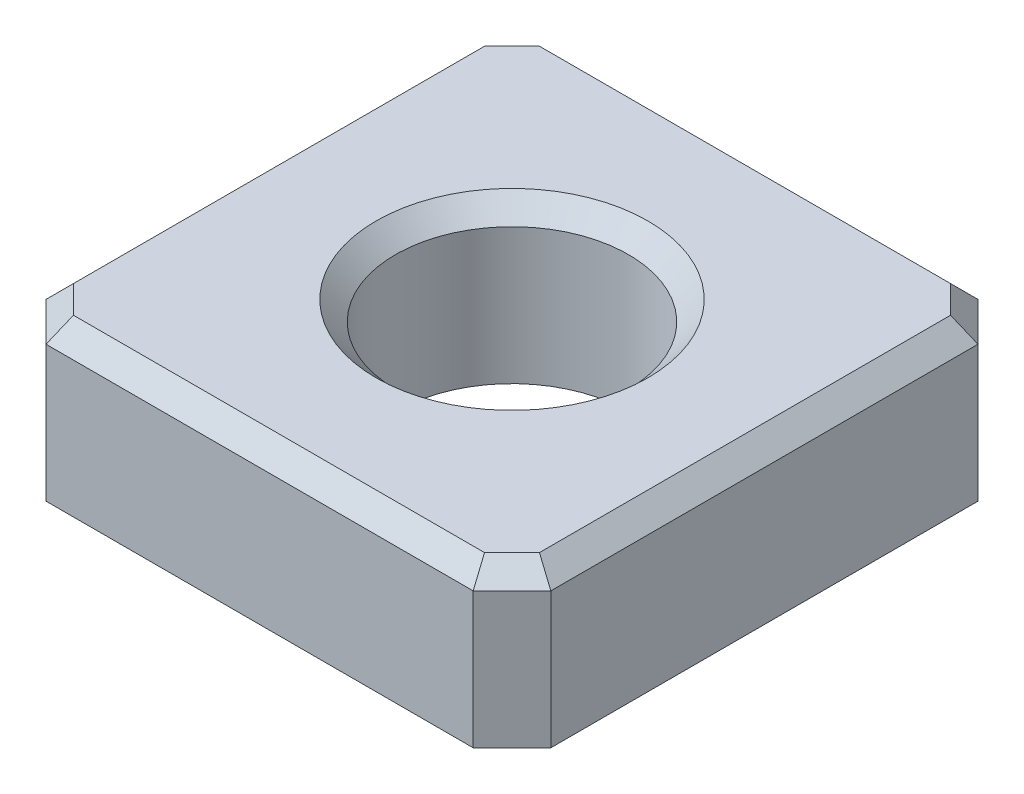
ISO-10303-21;
HEADER;
FILE_DESCRIPTION(('STEP AP214'),'2;1');
FILE_NAME('part.step','',(''),(''),'','','');
FILE_SCHEMA(('AUTOMOTIVE_DESIGN { 1 0 10303 214 1 1 1 1 }'));
ENDSEC;
DATA;
#1=APPLICATION_CONTEXT('core data for automotive mechanical design processes');
#2=APPLICATION_PROTOCOL_DEFINITION('international standard','automotive_design',2000,#1);
#3=PRODUCT_CONTEXT('',#1,'mechanical');
#4=PRODUCT('Part','Part','',(#3));
#5=PRODUCT_RELATED_PRODUCT_CATEGORY('part','',(#4));
#6=PRODUCT_DEFINITION_FORMATION('','',#4);
#7=PRODUCT_DEFINITION_CONTEXT('part definition',#1,'design');
#8=PRODUCT_DEFINITION('design','',#6,#7);
#9=PRODUCT_DEFINITION_SHAPE('','',#8);
#10=(LENGTH_UNIT() NAMED_UNIT(*) SI_UNIT(.MILLI.,.METRE.));
#11=(NAMED_UNIT(*) PLANE_ANGLE_UNIT() SI_UNIT($,.RADIAN.));
#12=(NAMED_UNIT(*) SI_UNIT($,.STERADIAN.) SOLID_ANGLE_UNIT());
#13=UNCERTAINTY_MEASURE_WITH_UNIT(LENGTH_MEASURE(1.E-05),#10,'distance_accuracy_value','');
#14=(GEOMETRIC_REPRESENTATION_CONTEXT(3) GLOBAL_UNCERTAINTY_ASSIGNED_CONTEXT((#13)) GLOBAL_UNIT_ASSIGNED_CONTEXT((#10,
#11,#12)) REPRESENTATION_CONTEXT('',''));
#15=CARTESIAN_POINT('',(0.,0.,0.));
#16=DIRECTION('',(0.,0.,1.));
#17=DIRECTION('',(1.,0.,0.));
#18=AXIS2_PLACEMENT_3D('',#15,#16,#17);
#19=CARTESIAN_POINT('',(0.,4.,0.));
#20=DIRECTION('',(0.,1.,0.));
#21=DIRECTION('',(0.,0.,1.));
#22=AXIS2_PLACEMENT_3D('',#19,#20,#21);
#23=PLANE('',#22);
#24=CARTESIAN_POINT('',(0.,4.,0.));
#25=DIRECTION('',(0.,1.,0.));
#26=DIRECTION('',(0.,0.,1.));
#27=AXIS2_PLACEMENT_3D('',#24,#25,#26);
#28=CIRCLE('',#27,3.5);
#29=CARTESIAN_POINT('',(0.,4.,3.5));
#30=VERTEX_POINT('',#29);
#31=EDGE_CURVE('E197',#30,#30,#28,.F.);
#32=ORIENTED_EDGE('',*,*,#31,.T.);
#33=EDGE_LOOP('',(#32));
#34=FACE_BOUND('',#33,.T.);
#35=DIRECTION('',(0.,0.,-1.));
#36=VECTOR('',#35,1.);
#37=CARTESIAN_POINT('',(6.00000000000003,4.,-5.5));
#38=LINE('',#37,#36);
#39=CARTESIAN_POINT('',(6.00000000000003,4.,5.29289321881345));
#40=VERTEX_POINT('',#39);
#41=CARTESIAN_POINT('',(6.00000000000003,4.,-5.29289321881345));
#42=VERTEX_POINT('',#41);
#43=EDGE_CURVE('E192',#40,#42,#38,.T.);
#44=ORIENTED_EDGE('',*,*,#43,.T.);
#45=DIRECTION('',(-0.707106781186546,0.,-0.707106781186549));
#46=VECTOR('',#45,1.);
#47=CARTESIAN_POINT('',(5.64644660940675,4.,-5.64644660940673));
#48=LINE('',#47,#46);
#49=CARTESIAN_POINT('',(5.29289321881349,4.,-6.));
#50=VERTEX_POINT('',#49);
#51=EDGE_CURVE('E194',#42,#50,#48,.T.);
#52=ORIENTED_EDGE('',*,*,#51,.T.);
#53=DIRECTION('',(-1.,0.,0.));
#54=VECTOR('',#53,1.);
#55=CARTESIAN_POINT('',(-5.50000000000003,4.,-6.));
#56=LINE('',#55,#54);
#57=CARTESIAN_POINT('',(-5.29289321881348,4.,-6.));
#58=VERTEX_POINT('',#57);
#59=EDGE_CURVE('E180',#50,#58,#56,.T.);
#60=ORIENTED_EDGE('',*,*,#59,.T.);
#61=DIRECTION('',(-0.707106781186549,0.,0.707106781186546));
#62=VECTOR('',#61,1.);
#63=CARTESIAN_POINT('',(-5.64644660940673,4.,-5.64644660940675));
#64=LINE('',#63,#62);
#65=CARTESIAN_POINT('',(-6.00000000000003,4.,-5.29289321881345));
#66=VERTEX_POINT('',#65);
#67=EDGE_CURVE('E182',#58,#66,#64,.T.);
#68=ORIENTED_EDGE('',*,*,#67,.T.);
#69=DIRECTION('',(0.,0.,1.));
#70=VECTOR('',#69,1.);
#71=CARTESIAN_POINT('',(-6.00000000000003,4.,5.5));
#72=LINE('',#71,#70);
#73=CARTESIAN_POINT('',(-6.00000000000003,4.,5.29289321881345));
#74=VERTEX_POINT('',#73);
#75=EDGE_CURVE('E184',#66,#74,#72,.T.);
#76=ORIENTED_EDGE('',*,*,#75,.T.);
#77=DIRECTION('',(0.707106781186546,0.,0.707106781186549));
#78=VECTOR('',#77,1.);
#79=CARTESIAN_POINT('',(-5.64644660940675,4.,5.64644660940673));
#80=LINE('',#79,#78);
#81=CARTESIAN_POINT('',(-5.29289321881349,4.,6.));
#82=VERTEX_POINT('',#81);
#83=EDGE_CURVE('E186',#74,#82,#80,.T.);
#84=ORIENTED_EDGE('',*,*,#83,.T.);
#85=DIRECTION('',(1.,0.,0.));
#86=VECTOR('',#85,1.);
#87=CARTESIAN_POINT('',(5.50000000000003,4.,6.));
#88=LINE('',#87,#86);
#89=CARTESIAN_POINT('',(5.29289321881348,4.,6.));
#90=VERTEX_POINT('',#89);
#91=EDGE_CURVE('E188',#82,#90,#88,.T.);
#92=ORIENTED_EDGE('',*,*,#91,.T.);
#93=DIRECTION('',(0.707106781186549,0.,-0.707106781186546));
#94=VECTOR('',#93,1.);
#95=CARTESIAN_POINT('',(5.64644660940673,4.,5.64644660940675));
#96=LINE('',#95,#94);
#97=EDGE_CURVE('E190',#90,#40,#96,.T.);
#98=ORIENTED_EDGE('',*,*,#97,.T.);
#99=EDGE_LOOP('',(#44,#52,#60,#68,#76,#84,#92,#98));
#100=FACE_BOUND('',#99,.T.);
#101=ADVANCED_FACE('F38',(#34,#100),#23,.T.);
#102=CARTESIAN_POINT('',(0.,0.,0.));
#103=DIRECTION('',(0.,1.,0.));
#104=DIRECTION('',(0.,0.,1.));
#105=AXIS2_PLACEMENT_3D('',#102,#103,#104);
#106=PLANE('',#105);
#107=DIRECTION('',(0.,0.,1.));
#108=VECTOR('',#107,1.);
#109=CARTESIAN_POINT('',(-6.50000000000003,0.,-6.5));
#110=LINE('',#109,#108);
#111=CARTESIAN_POINT('',(-6.50000000000003,0.,-5.5));
#112=VERTEX_POINT('',#111);
#113=CARTESIAN_POINT('',(-6.50000000000003,0.,5.5));
#114=VERTEX_POINT('',#113);
#115=EDGE_CURVE('E132',#112,#114,#110,.T.);
#116=ORIENTED_EDGE('',*,*,#115,.F.);
#117=DIRECTION('',(-0.707106781186549,0.,0.707106781186546));
#118=VECTOR('',#117,1.);
#119=CARTESIAN_POINT('',(-6.50000000000003,0.,-5.5));
#120=LINE('',#119,#118);
#121=CARTESIAN_POINT('',(-5.50000000000003,0.,-6.5));
#122=VERTEX_POINT('',#121);
#123=EDGE_CURVE('E138',#112,#122,#120,.F.);
#124=ORIENTED_EDGE('',*,*,#123,.T.);
#125=DIRECTION('',(-1.,0.,0.));
#126=VECTOR('',#125,1.);
#127=CARTESIAN_POINT('',(-6.50000000000003,0.,-6.5));
#128=LINE('',#127,#126);
#129=CARTESIAN_POINT('',(5.50000000000003,0.,-6.5));
#130=VERTEX_POINT('',#129);
#131=EDGE_CURVE('E152',#130,#122,#128,.T.);
#132=ORIENTED_EDGE('',*,*,#131,.F.);
#133=DIRECTION('',(-0.707106781186546,0.,-0.707106781186549));
#134=VECTOR('',#133,1.);
#135=CARTESIAN_POINT('',(5.50000000000003,0.,-6.5));
#136=LINE('',#135,#134);
#137=CARTESIAN_POINT('',(6.50000000000003,0.,-5.5));
#138=VERTEX_POINT('',#137);
#139=EDGE_CURVE('E162',#130,#138,#136,.F.);
#140=ORIENTED_EDGE('',*,*,#139,.T.);
#141=DIRECTION('',(0.,0.,-1.));
#142=VECTOR('',#141,1.);
#143=CARTESIAN_POINT('',(6.50000000000003,0.,-6.5));
#144=LINE('',#143,#142);
#145=CARTESIAN_POINT('',(6.50000000000003,0.,5.5));
#146=VERTEX_POINT('',#145);
#147=EDGE_CURVE('E156',#146,#138,#144,.T.);
#148=ORIENTED_EDGE('',*,*,#147,.F.);
#149=DIRECTION('',(0.707106781186549,0.,-0.707106781186546));
#150=VECTOR('',#149,1.);
#151=CARTESIAN_POINT('',(6.50000000000003,0.,5.5));
#152=LINE('',#151,#150);
#153=CARTESIAN_POINT('',(5.50000000000003,0.,6.5));
#154=VERTEX_POINT('',#153);
#155=EDGE_CURVE('E135',#146,#154,#152,.F.);
#156=ORIENTED_EDGE('',*,*,#155,.T.);
#157=DIRECTION('',(1.,0.,0.));
#158=VECTOR('',#157,1.);
#159=CARTESIAN_POINT('',(-6.50000000000003,0.,6.5));
#160=LINE('',#159,#158);
#161=CARTESIAN_POINT('',(-5.50000000000003,0.,6.5));
#162=VERTEX_POINT('',#161);
#163=EDGE_CURVE('E151',#162,#154,#160,.T.);
#164=ORIENTED_EDGE('',*,*,#163,.F.);
#165=DIRECTION('',(0.707106781186546,0.,0.707106781186549));
#166=VECTOR('',#165,1.);
#167=CARTESIAN_POINT('',(-5.50000000000003,0.,6.5));
#168=LINE('',#167,#166);
#169=EDGE_CURVE('E145',#162,#114,#168,.F.);
#170=ORIENTED_EDGE('',*,*,#169,.T.);
#171=EDGE_LOOP('',(#116,#124,#132,#140,#148,#156,#164,#170));
#172=FACE_BOUND('',#171,.T.);
#173=CARTESIAN_POINT('',(0.,0.,0.));
#174=DIRECTION('',(0.,1.,0.));
#175=DIRECTION('',(0.,0.,1.));
#176=AXIS2_PLACEMENT_3D('',#173,#174,#175);
#177=CIRCLE('',#176,3.);
#178=CARTESIAN_POINT('',(0.,0.,3.));
#179=VERTEX_POINT('',#178);
#180=EDGE_CURVE('E234',#179,#179,#177,.T.);
#181=ORIENTED_EDGE('',*,*,#180,.T.);
#182=EDGE_LOOP('',(#181));
#183=FACE_BOUND('',#182,.T.);
#184=ADVANCED_FACE('F147',(#172,#183),#106,.F.);
#185=CARTESIAN_POINT('',(6.50000000000003,4.,-6.5));
#186=DIRECTION('',(-1.,0.,0.));
#187=DIRECTION('',(0.,0.,1.));
#188=AXIS2_PLACEMENT_3D('',#185,#186,#187);
#189=PLANE('',#188);
#190=DIRECTION('',(0.,1.,0.));
#191=VECTOR('',#190,1.);
#192=CARTESIAN_POINT('',(6.50000000000003,4.,-5.5));
#193=LINE('',#192,#191);
#194=CARTESIAN_POINT('',(6.50000000000003,3.5,-5.5));
#195=VERTEX_POINT('',#194);
#196=EDGE_CURVE('E174',#138,#195,#193,.T.);
#197=ORIENTED_EDGE('',*,*,#196,.T.);
#198=DIRECTION('',(0.,0.,1.));
#199=VECTOR('',#198,1.);
#200=CARTESIAN_POINT('',(6.50000000000003,3.5,5.5));
#201=LINE('',#200,#199);
#202=CARTESIAN_POINT('',(6.50000000000003,3.5,5.5));
#203=VERTEX_POINT('',#202);
#204=EDGE_CURVE('E203',#195,#203,#201,.T.);
#205=ORIENTED_EDGE('',*,*,#204,.T.);
#206=DIRECTION('',(0.,-1.,0.));
#207=VECTOR('',#206,1.);
#208=CARTESIAN_POINT('',(6.50000000000003,4.,5.5));
#209=LINE('',#208,#207);
#210=EDGE_CURVE('E172',#203,#146,#209,.T.);
#211=ORIENTED_EDGE('',*,*,#210,.T.);
#212=ORIENTED_EDGE('',*,*,#147,.T.);
#213=EDGE_LOOP('',(#197,#205,#211,#212));
#214=FACE_BOUND('',#213,.T.);
#215=ADVANCED_FACE('F246',(#214),#189,.F.);
#216=CARTESIAN_POINT('',(-6.50000000000003,4.,-6.5));
#217=DIRECTION('',(0.,0.,1.));
#218=DIRECTION('',(1.,0.,0.));
#219=AXIS2_PLACEMENT_3D('',#216,#217,#218);
#220=PLANE('',#219);
#221=DIRECTION('',(0.,1.,0.));
#222=VECTOR('',#221,1.);
#223=CARTESIAN_POINT('',(-5.50000000000003,4.,-6.5));
#224=LINE('',#223,#222);
#225=CARTESIAN_POINT('',(-5.50000000000003,3.5,-6.5));
#226=VERTEX_POINT('',#225);
#227=EDGE_CURVE('E140',#122,#226,#224,.T.);
#228=ORIENTED_EDGE('',*,*,#227,.T.);
#229=DIRECTION('',(1.,0.,0.));
#230=VECTOR('',#229,1.);
#231=CARTESIAN_POINT('',(5.50000000000003,3.5,-6.5));
#232=LINE('',#231,#230);
#233=CARTESIAN_POINT('',(5.50000000000003,3.5,-6.5));
#234=VERTEX_POINT('',#233);
#235=EDGE_CURVE('E11',#226,#234,#232,.T.);
#236=ORIENTED_EDGE('',*,*,#235,.T.);
#237=DIRECTION('',(0.,-1.,0.));
#238=VECTOR('',#237,1.);
#239=CARTESIAN_POINT('',(5.50000000000003,4.,-6.5));
#240=LINE('',#239,#238);
#241=EDGE_CURVE('E144',#234,#130,#240,.T.);
#242=ORIENTED_EDGE('',*,*,#241,.T.);
#243=ORIENTED_EDGE('',*,*,#131,.T.);
#244=EDGE_LOOP('',(#228,#236,#242,#243));
#245=FACE_BOUND('',#244,.T.);
#246=ADVANCED_FACE('F314',(#245),#220,.F.);
#247=CARTESIAN_POINT('',(-6.50000000000003,4.,-6.5));
#248=DIRECTION('',(1.,0.,0.));
#249=DIRECTION('',(0.,0.,-1.));
#250=AXIS2_PLACEMENT_3D('',#247,#248,#249);
#251=PLANE('',#250);
#252=DIRECTION('',(0.,1.,0.));
#253=VECTOR('',#252,1.);
#254=CARTESIAN_POINT('',(-6.50000000000003,4.,5.5));
#255=LINE('',#254,#253);
#256=CARTESIAN_POINT('',(-6.50000000000003,3.5,5.5));
#257=VERTEX_POINT('',#256);
#258=EDGE_CURVE('E136',#114,#257,#255,.T.);
#259=ORIENTED_EDGE('',*,*,#258,.T.);
#260=DIRECTION('',(0.,0.,-1.));
#261=VECTOR('',#260,1.);
#262=CARTESIAN_POINT('',(-6.50000000000003,3.5,-5.5));
#263=LINE('',#262,#261);
#264=CARTESIAN_POINT('',(-6.50000000000003,3.5,-5.5));
#265=VERTEX_POINT('',#264);
#266=EDGE_CURVE('E63',#257,#265,#263,.T.);
#267=ORIENTED_EDGE('',*,*,#266,.T.);
#268=DIRECTION('',(0.,-1.,0.));
#269=VECTOR('',#268,1.);
#270=CARTESIAN_POINT('',(-6.50000000000003,4.,-5.5));
#271=LINE('',#270,#269);
#272=EDGE_CURVE('E128',#265,#112,#271,.T.);
#273=ORIENTED_EDGE('',*,*,#272,.T.);
#274=ORIENTED_EDGE('',*,*,#115,.T.);
#275=EDGE_LOOP('',(#259,#267,#273,#274));
#276=FACE_BOUND('',#275,.T.);
#277=ADVANCED_FACE('F130',(#276),#251,.F.);
#278=CARTESIAN_POINT('',(-6.50000000000003,4.,6.5));
#279=DIRECTION('',(0.,0.,-1.));
#280=DIRECTION('',(-1.,0.,0.));
#281=AXIS2_PLACEMENT_3D('',#278,#279,#280);
#282=PLANE('',#281);
#283=DIRECTION('',(0.,1.,0.));
#284=VECTOR('',#283,1.);
#285=CARTESIAN_POINT('',(5.50000000000003,4.,6.5));
#286=LINE('',#285,#284);
#287=CARTESIAN_POINT('',(5.50000000000003,3.5,6.5));
#288=VERTEX_POINT('',#287);
#289=EDGE_CURVE('E167',#154,#288,#286,.T.);
#290=ORIENTED_EDGE('',*,*,#289,.T.);
#291=DIRECTION('',(-1.,0.,0.));
#292=VECTOR('',#291,1.);
#293=CARTESIAN_POINT('',(-5.50000000000003,3.5,6.5));
#294=LINE('',#293,#292);
#295=CARTESIAN_POINT('',(-5.50000000000003,3.5,6.5));
#296=VERTEX_POINT('',#295);
#297=EDGE_CURVE('E207',#288,#296,#294,.T.);
#298=ORIENTED_EDGE('',*,*,#297,.T.);
#299=DIRECTION('',(0.,-1.,0.));
#300=VECTOR('',#299,1.);
#301=CARTESIAN_POINT('',(-5.50000000000003,4.,6.5));
#302=LINE('',#301,#300);
#303=EDGE_CURVE('E170',#296,#162,#302,.T.);
#304=ORIENTED_EDGE('',*,*,#303,.T.);
#305=ORIENTED_EDGE('',*,*,#163,.T.);
#306=EDGE_LOOP('',(#290,#298,#304,#305));
#307=FACE_BOUND('',#306,.T.);
#308=ADVANCED_FACE('F282',(#307),#282,.F.);
#309=CARTESIAN_POINT('',(0.,4.,0.));
#310=DIRECTION('',(0.,-1.,0.));
#311=DIRECTION('',(0.,0.,-1.));
#312=AXIS2_PLACEMENT_3D('',#309,#310,#311);
#313=CYLINDRICAL_SURFACE('',#312,3.);
#314=CARTESIAN_POINT('',(0.,3.5,0.));
#315=DIRECTION('',(0.,1.,0.));
#316=DIRECTION('',(0.,0.,1.));
#317=AXIS2_PLACEMENT_3D('',#314,#315,#316);
#318=CIRCLE('',#317,3.);
#319=CARTESIAN_POINT('',(0.,3.5,3.));
#320=VERTEX_POINT('',#319);
#321=EDGE_CURVE('E177',#320,#320,#318,.T.);
#322=ORIENTED_EDGE('',*,*,#321,.T.);
#323=EDGE_LOOP('',(#322));
#324=FACE_BOUND('',#323,.T.);
#325=ORIENTED_EDGE('',*,*,#180,.F.);
#326=EDGE_LOOP('',(#325));
#327=FACE_BOUND('',#326,.T.);
#328=ADVANCED_FACE('F308',(#324,#327),#313,.F.);
#329=CARTESIAN_POINT('',(-6.50000000000003,4.,-5.5));
#330=DIRECTION('',(0.707106781186546,0.,0.707106781186549));
#331=DIRECTION('',(0.,-1.,0.));
#332=AXIS2_PLACEMENT_3D('',#329,#330,#331);
#333=PLANE('',#332);
#334=ORIENTED_EDGE('',*,*,#272,.F.);
#335=DIRECTION('',(-0.707106781186549,0.,0.707106781186546));
#336=VECTOR('',#335,1.);
#337=CARTESIAN_POINT('',(-6.50000000000003,3.5,-5.5));
#338=LINE('',#337,#336);
#339=EDGE_CURVE('E48',#265,#226,#338,.F.);
#340=ORIENTED_EDGE('',*,*,#339,.T.);
#341=ORIENTED_EDGE('',*,*,#227,.F.);
#342=ORIENTED_EDGE('',*,*,#123,.F.);
#343=EDGE_LOOP('',(#334,#340,#341,#342));
#344=FACE_BOUND('',#343,.T.);
#345=ADVANCED_FACE('F139',(#344),#333,.F.);
#346=CARTESIAN_POINT('',(-5.50000000000003,4.,6.5));
#347=DIRECTION('',(0.707106781186549,0.,-0.707106781186546));
#348=DIRECTION('',(0.,-1.,0.));
#349=AXIS2_PLACEMENT_3D('',#346,#347,#348);
#350=PLANE('',#349);
#351=ORIENTED_EDGE('',*,*,#303,.F.);
#352=DIRECTION('',(0.707106781186546,0.,0.707106781186549));
#353=VECTOR('',#352,1.);
#354=CARTESIAN_POINT('',(-5.50000000000003,3.5,6.5));
#355=LINE('',#354,#353);
#356=EDGE_CURVE('E209',#296,#257,#355,.F.);
#357=ORIENTED_EDGE('',*,*,#356,.T.);
#358=ORIENTED_EDGE('',*,*,#258,.F.);
#359=ORIENTED_EDGE('',*,*,#169,.F.);
#360=EDGE_LOOP('',(#351,#357,#358,#359));
#361=FACE_BOUND('',#360,.T.);
#362=ADVANCED_FACE('F285',(#361),#350,.F.);
#363=CARTESIAN_POINT('',(5.50000000000003,4.,-6.5));
#364=DIRECTION('',(-0.707106781186549,0.,0.707106781186546));
#365=DIRECTION('',(0.,-1.,0.));
#366=AXIS2_PLACEMENT_3D('',#363,#364,#365);
#367=PLANE('',#366);
#368=ORIENTED_EDGE('',*,*,#241,.F.);
#369=DIRECTION('',(-0.707106781186546,0.,-0.707106781186549));
#370=VECTOR('',#369,1.);
#371=CARTESIAN_POINT('',(5.50000000000003,3.5,-6.5));
#372=LINE('',#371,#370);
#373=EDGE_CURVE('E200',#234,#195,#372,.F.);
#374=ORIENTED_EDGE('',*,*,#373,.T.);
#375=ORIENTED_EDGE('',*,*,#196,.F.);
#376=ORIENTED_EDGE('',*,*,#139,.F.);
#377=EDGE_LOOP('',(#368,#374,#375,#376));
#378=FACE_BOUND('',#377,.T.);
#379=ADVANCED_FACE('F252',(#378),#367,.F.);
#380=CARTESIAN_POINT('',(6.50000000000003,4.,5.5));
#381=DIRECTION('',(-0.707106781186546,0.,-0.707106781186549));
#382=DIRECTION('',(0.,-1.,0.));
#383=AXIS2_PLACEMENT_3D('',#380,#381,#382);
#384=PLANE('',#383);
#385=ORIENTED_EDGE('',*,*,#210,.F.);
#386=DIRECTION('',(0.707106781186549,0.,-0.707106781186546));
#387=VECTOR('',#386,1.);
#388=CARTESIAN_POINT('',(6.50000000000003,3.5,5.5));
#389=LINE('',#388,#387);
#390=EDGE_CURVE('E205',#203,#288,#389,.F.);
#391=ORIENTED_EDGE('',*,*,#390,.T.);
#392=ORIENTED_EDGE('',*,*,#289,.F.);
#393=ORIENTED_EDGE('',*,*,#155,.F.);
#394=EDGE_LOOP('',(#385,#391,#392,#393));
#395=FACE_BOUND('',#394,.T.);
#396=ADVANCED_FACE('F274',(#395),#384,.F.);
#397=CARTESIAN_POINT('',(0.,3.5,0.));
#398=DIRECTION('',(0.,1.,0.));
#399=DIRECTION('',(0.,0.,1.));
#400=AXIS2_PLACEMENT_3D('',#397,#398,#399);
#401=CONICAL_SURFACE('',#400,3.,0.78539816339745);
#402=ORIENTED_EDGE('',*,*,#31,.F.);
#403=EDGE_LOOP('',(#402));
#404=FACE_BOUND('',#403,.T.);
#405=ORIENTED_EDGE('',*,*,#321,.F.);
#406=EDGE_LOOP('',(#405));
#407=FACE_BOUND('',#406,.T.);
#408=ADVANCED_FACE('F341',(#404,#407),#401,.F.);
#409=CARTESIAN_POINT('',(-5.64644660940675,4.,5.64644660940673));
#410=DIRECTION('',(-0.5,0.707106781186548,0.499999999999999));
#411=DIRECTION('',(-0.707106781186546,0.,-0.707106781186549));
#412=AXIS2_PLACEMENT_3D('',#409,#410,#411);
#413=PLANE('',#412);
#414=DIRECTION('',(0.678598344545847,0.678598344545847,-0.281084637714821));
#415=VECTOR('',#414,1.);
#416=CARTESIAN_POINT('',(-4.99041465271166,5.00958534728837,4.87470927559345));
#417=LINE('',#416,#415);
#418=EDGE_CURVE('E228',#257,#74,#417,.T.);
#419=ORIENTED_EDGE('',*,*,#418,.F.);
#420=ORIENTED_EDGE('',*,*,#356,.F.);
#421=DIRECTION('',(0.281084637714823,0.678598344545847,-0.678598344545847));
#422=VECTOR('',#421,1.);
#423=CARTESIAN_POINT('',(-5.25338893203385,4.09537178491527,5.90462821508473));
#424=LINE('',#423,#422);
#425=EDGE_CURVE('E43',#82,#296,#424,.F.);
#426=ORIENTED_EDGE('',*,*,#425,.F.);
#427=ORIENTED_EDGE('',*,*,#83,.F.);
#428=EDGE_LOOP('',(#419,#420,#426,#427));
#429=FACE_BOUND('',#428,.T.);
#430=ADVANCED_FACE('F41',(#429),#413,.T.);
#431=CARTESIAN_POINT('',(0.,4.,6.));
#432=DIRECTION('',(0.,0.707106781186547,0.707106781186547));
#433=DIRECTION('',(-1.,0.,0.));
#434=AXIS2_PLACEMENT_3D('',#431,#432,#433);
#435=PLANE('',#434);
#436=ORIENTED_EDGE('',*,*,#425,.T.);
#437=ORIENTED_EDGE('',*,*,#297,.F.);
#438=DIRECTION('',(-0.281084637714821,0.678598344545847,-0.678598344545847));
#439=VECTOR('',#438,1.);
#440=CARTESIAN_POINT('',(4.87470927559348,5.00958534728838,4.99041465271162));
#441=LINE('',#440,#439);
#442=EDGE_CURVE('E226',#90,#288,#441,.F.);
#443=ORIENTED_EDGE('',*,*,#442,.F.);
#444=ORIENTED_EDGE('',*,*,#91,.F.);
#445=EDGE_LOOP('',(#436,#437,#443,#444));
#446=FACE_BOUND('',#445,.T.);
#447=ADVANCED_FACE('F279',(#446),#435,.T.);
#448=CARTESIAN_POINT('',(-6.00000000000003,4.,0.));
#449=DIRECTION('',(-0.707106781186547,0.707106781186547,0.));
#450=DIRECTION('',(0.,0.,-1.));
#451=AXIS2_PLACEMENT_3D('',#448,#449,#450);
#452=PLANE('',#451);
#453=ORIENTED_EDGE('',*,*,#418,.T.);
#454=ORIENTED_EDGE('',*,*,#75,.F.);
#455=DIRECTION('',(0.678598344545847,0.678598344545847,0.281084637714822));
#456=VECTOR('',#455,1.);
#457=CARTESIAN_POINT('',(-5.90462821508475,4.09537178491528,-5.25338893203381));
#458=LINE('',#457,#456);
#459=EDGE_CURVE('E223',#265,#66,#458,.T.);
#460=ORIENTED_EDGE('',*,*,#459,.F.);
#461=ORIENTED_EDGE('',*,*,#266,.F.);
#462=EDGE_LOOP('',(#453,#454,#460,#461));
#463=FACE_BOUND('',#462,.T.);
#464=ADVANCED_FACE('F288',(#463),#452,.T.);
#465=CARTESIAN_POINT('',(5.64644660940673,4.,5.64644660940675));
#466=DIRECTION('',(0.499999999999999,0.707106781186548,0.500000000000001));
#467=DIRECTION('',(-0.707106781186549,0.,0.707106781186546));
#468=AXIS2_PLACEMENT_3D('',#465,#466,#467);
#469=PLANE('',#468);
#470=ORIENTED_EDGE('',*,*,#442,.T.);
#471=ORIENTED_EDGE('',*,*,#390,.F.);
#472=DIRECTION('',(-0.678598344545847,0.678598344545847,-0.281084637714822));
#473=VECTOR('',#472,1.);
#474=CARTESIAN_POINT('',(5.90462821508475,4.09537178491528,5.25338893203381));
#475=LINE('',#474,#473);
#476=EDGE_CURVE('E220',#40,#203,#475,.F.);
#477=ORIENTED_EDGE('',*,*,#476,.F.);
#478=ORIENTED_EDGE('',*,*,#97,.F.);
#479=EDGE_LOOP('',(#470,#471,#477,#478));
#480=FACE_BOUND('',#479,.T.);
#481=ADVANCED_FACE('F277',(#480),#469,.T.);
#482=CARTESIAN_POINT('',(-5.64644660940673,4.,-5.64644660940675));
#483=DIRECTION('',(-0.499999999999999,0.707106781186548,-0.500000000000001));
#484=DIRECTION('',(0.707106781186549,0.,-0.707106781186546));
#485=AXIS2_PLACEMENT_3D('',#482,#483,#484);
#486=PLANE('',#485);
#487=ORIENTED_EDGE('',*,*,#459,.T.);
#488=ORIENTED_EDGE('',*,*,#67,.F.);
#489=DIRECTION('',(0.281084637714821,0.678598344545847,0.678598344545847));
#490=VECTOR('',#489,1.);
#491=CARTESIAN_POINT('',(-4.87470927559348,5.00958534728838,-4.99041465271162));
#492=LINE('',#491,#490);
#493=EDGE_CURVE('E217',#226,#58,#492,.T.);
#494=ORIENTED_EDGE('',*,*,#493,.F.);
#495=ORIENTED_EDGE('',*,*,#339,.F.);
#496=EDGE_LOOP('',(#487,#488,#494,#495));
#497=FACE_BOUND('',#496,.T.);
#498=ADVANCED_FACE('F290',(#497),#486,.T.);
#499=CARTESIAN_POINT('',(6.00000000000003,4.,0.));
#500=DIRECTION('',(0.707106781186547,0.707106781186547,0.));
#501=DIRECTION('',(0.,0.,1.));
#502=AXIS2_PLACEMENT_3D('',#499,#500,#501);
#503=PLANE('',#502);
#504=ORIENTED_EDGE('',*,*,#476,.T.);
#505=ORIENTED_EDGE('',*,*,#204,.F.);
#506=DIRECTION('',(-0.678598344545847,0.678598344545847,0.281084637714821));
#507=VECTOR('',#506,1.);
#508=CARTESIAN_POINT('',(4.99041465271166,5.00958534728837,-4.87470927559345));
#509=LINE('',#508,#507);
#510=EDGE_CURVE('E215',#42,#195,#509,.F.);
#511=ORIENTED_EDGE('',*,*,#510,.F.);
#512=ORIENTED_EDGE('',*,*,#43,.F.);
#513=EDGE_LOOP('',(#504,#505,#511,#512));
#514=FACE_BOUND('',#513,.T.);
#515=ADVANCED_FACE('F271',(#514),#503,.T.);
#516=CARTESIAN_POINT('',(0.,4.,-6.));
#517=DIRECTION('',(0.,0.707106781186547,-0.707106781186547));
#518=DIRECTION('',(1.,0.,0.));
#519=AXIS2_PLACEMENT_3D('',#516,#517,#518);
#520=PLANE('',#519);
#521=ORIENTED_EDGE('',*,*,#493,.T.);
#522=ORIENTED_EDGE('',*,*,#59,.F.);
#523=DIRECTION('',(0.281084637714823,-0.678598344545847,-0.678598344545847));
#524=VECTOR('',#523,1.);
#525=CARTESIAN_POINT('',(4.87470927559348,5.00958534728838,-4.99041465271162));
#526=LINE('',#525,#524);
#527=EDGE_CURVE('E213',#234,#50,#526,.F.);
#528=ORIENTED_EDGE('',*,*,#527,.F.);
#529=ORIENTED_EDGE('',*,*,#235,.F.);
#530=EDGE_LOOP('',(#521,#522,#528,#529));
#531=FACE_BOUND('',#530,.T.);
#532=ADVANCED_FACE('F263',(#531),#520,.T.);
#533=CARTESIAN_POINT('',(5.64644660940675,4.,-5.64644660940673));
#534=DIRECTION('',(0.5,0.707106781186548,-0.499999999999999));
#535=DIRECTION('',(0.707106781186546,0.,0.707106781186549));
#536=AXIS2_PLACEMENT_3D('',#533,#534,#535);
#537=PLANE('',#536);
#538=ORIENTED_EDGE('',*,*,#510,.T.);
#539=ORIENTED_EDGE('',*,*,#373,.F.);
#540=ORIENTED_EDGE('',*,*,#527,.T.);
#541=ORIENTED_EDGE('',*,*,#51,.F.);
#542=EDGE_LOOP('',(#538,#539,#540,#541));
#543=FACE_BOUND('',#542,.T.);
#544=ADVANCED_FACE('F256',(#543),#537,.T.);
#545=CLOSED_SHELL('',(#101,#184,#215,#246,#277,#308,#328,#345,#362,#379,#396,#408,#430,#447,
#464,#481,#498,#515,#532,#544));
#546=MANIFOLD_SOLID_BREP('B2',#545);
#547=ADVANCED_BREP_SHAPE_REPRESENTATION('',(#18,#546),#14);
#548=SHAPE_DEFINITION_REPRESENTATION(#9,#547);
ENDSEC;
END-ISO-10303-21;
